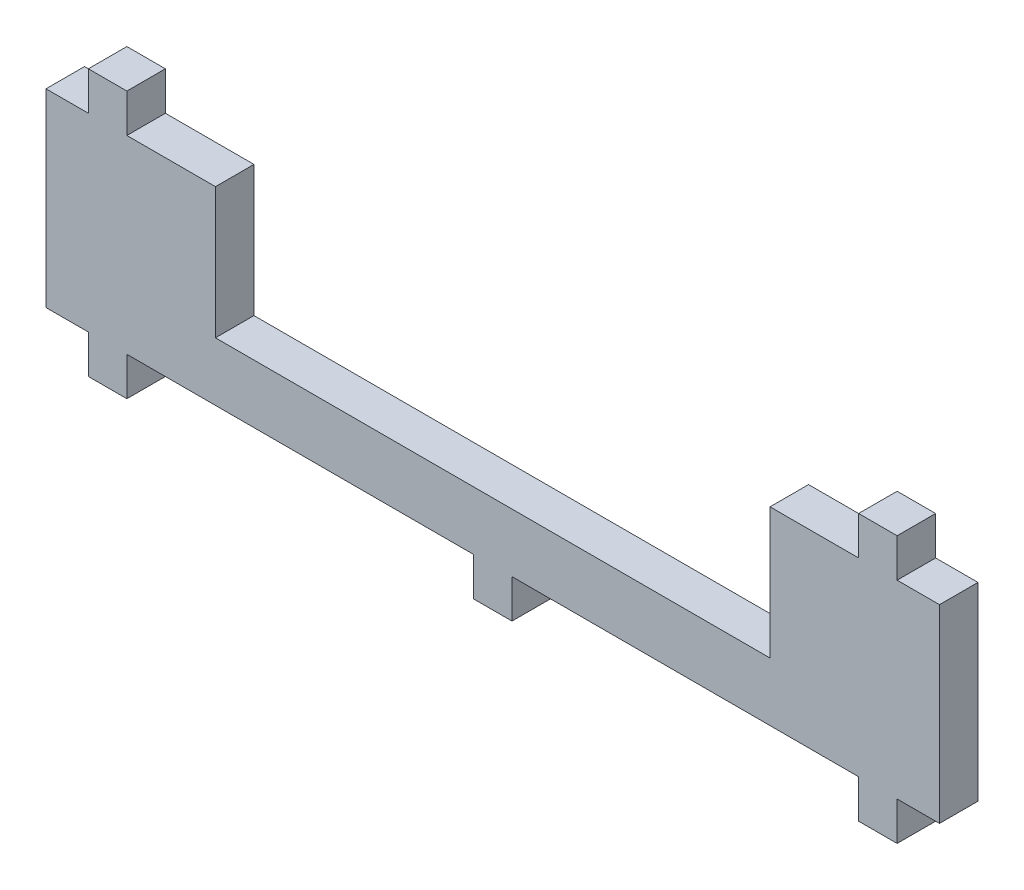
ISO-10303-21;
HEADER;
FILE_DESCRIPTION(('STEP AP214'),'2;1');
FILE_NAME('part.step','',(''),(''),'','','');
FILE_SCHEMA(('AUTOMOTIVE_DESIGN { 1 0 10303 214 1 1 1 1 }'));
ENDSEC;
DATA;
#1=APPLICATION_CONTEXT('core data for automotive mechanical design processes');
#2=APPLICATION_PROTOCOL_DEFINITION('international standard','automotive_design',2000,#1);
#3=PRODUCT_CONTEXT('',#1,'mechanical');
#4=PRODUCT('Part','Part','',(#3));
#5=PRODUCT_RELATED_PRODUCT_CATEGORY('part','',(#4));
#6=PRODUCT_DEFINITION_FORMATION('','',#4);
#7=PRODUCT_DEFINITION_CONTEXT('part definition',#1,'design');
#8=PRODUCT_DEFINITION('design','',#6,#7);
#9=PRODUCT_DEFINITION_SHAPE('','',#8);
#10=(LENGTH_UNIT() NAMED_UNIT(*) SI_UNIT(.MILLI.,.METRE.));
#11=(NAMED_UNIT(*) PLANE_ANGLE_UNIT() SI_UNIT($,.RADIAN.));
#12=(NAMED_UNIT(*) SI_UNIT($,.STERADIAN.) SOLID_ANGLE_UNIT());
#13=UNCERTAINTY_MEASURE_WITH_UNIT(LENGTH_MEASURE(1.E-05),#10,'distance_accuracy_value','');
#14=(GEOMETRIC_REPRESENTATION_CONTEXT(3) GLOBAL_UNCERTAINTY_ASSIGNED_CONTEXT((#13)) GLOBAL_UNIT_ASSIGNED_CONTEXT((#10,
#11,#12)) REPRESENTATION_CONTEXT('',''));
#15=CARTESIAN_POINT('',(0.,0.,0.));
#16=DIRECTION('',(0.,0.,1.));
#17=DIRECTION('',(1.,0.,0.));
#18=AXIS2_PLACEMENT_3D('',#15,#16,#17);
#19=CARTESIAN_POINT('',(-58.,-6.15,5.));
#20=DIRECTION('',(0.,1.,0.));
#21=DIRECTION('',(0.,0.,1.));
#22=AXIS2_PLACEMENT_3D('',#19,#20,#21);
#23=PLANE('',#22);
#24=DIRECTION('',(0.,0.,-1.));
#25=VECTOR('',#24,1.);
#26=CARTESIAN_POINT('',(-2.5,-6.15,5.));
#27=LINE('',#26,#25);
#28=CARTESIAN_POINT('',(-2.50000000000002,-6.15,5.));
#29=VERTEX_POINT('',#28);
#30=CARTESIAN_POINT('',(-2.50000000000002,-6.15,0.));
#31=VERTEX_POINT('',#30);
#32=EDGE_CURVE('E58',#29,#31,#27,.T.);
#33=ORIENTED_EDGE('',*,*,#32,.F.);
#34=DIRECTION('',(1.,0.,0.));
#35=VECTOR('',#34,1.);
#36=CARTESIAN_POINT('',(-58.,-6.15,5.));
#37=LINE('',#36,#35);
#38=CARTESIAN_POINT('',(-47.5,-6.15,5.));
#39=VERTEX_POINT('',#38);
#40=EDGE_CURVE('E447',#39,#29,#37,.T.);
#41=ORIENTED_EDGE('',*,*,#40,.F.);
#42=DIRECTION('',(0.,0.,1.));
#43=VECTOR('',#42,1.);
#44=CARTESIAN_POINT('',(-47.5,-6.15,5.));
#45=LINE('',#44,#43);
#46=CARTESIAN_POINT('',(-47.5,-6.15,0.));
#47=VERTEX_POINT('',#46);
#48=EDGE_CURVE('E435',#47,#39,#45,.T.);
#49=ORIENTED_EDGE('',*,*,#48,.F.);
#50=DIRECTION('',(1.,0.,0.));
#51=VECTOR('',#50,1.);
#52=CARTESIAN_POINT('',(-58.,-6.15,0.));
#53=LINE('',#52,#51);
#54=EDGE_CURVE('E477',#47,#31,#53,.T.);
#55=ORIENTED_EDGE('',*,*,#54,.T.);
#56=EDGE_LOOP('',(#33,#41,#49,#55));
#57=FACE_BOUND('',#56,.T.);
#58=ADVANCED_FACE('F33',(#57),#23,.F.);
#59=DIRECTION('',(0.,0.,1.));
#60=VECTOR('',#59,1.);
#61=CARTESIAN_POINT('',(2.5,-6.15,5.));
#62=LINE('',#61,#60);
#63=CARTESIAN_POINT('',(2.5,-6.15,0.));
#64=VERTEX_POINT('',#63);
#65=CARTESIAN_POINT('',(2.49999999999998,-6.15,5.));
#66=VERTEX_POINT('',#65);
#67=EDGE_CURVE('E242',#64,#66,#62,.T.);
#68=ORIENTED_EDGE('',*,*,#67,.F.);
#69=CARTESIAN_POINT('',(47.5,-6.15,0.));
#70=VERTEX_POINT('',#69);
#71=EDGE_CURVE('E468',#64,#70,#53,.T.);
#72=ORIENTED_EDGE('',*,*,#71,.T.);
#73=DIRECTION('',(0.,0.,-1.));
#74=VECTOR('',#73,1.);
#75=CARTESIAN_POINT('',(47.5,-6.15,5.));
#76=LINE('',#75,#74);
#77=CARTESIAN_POINT('',(47.5,-6.15,5.));
#78=VERTEX_POINT('',#77);
#79=EDGE_CURVE('E354',#78,#70,#76,.T.);
#80=ORIENTED_EDGE('',*,*,#79,.F.);
#81=EDGE_CURVE('E37',#66,#78,#37,.T.);
#82=ORIENTED_EDGE('',*,*,#81,.F.);
#83=EDGE_LOOP('',(#68,#72,#80,#82));
#84=FACE_BOUND('',#83,.T.);
#85=ADVANCED_FACE('F406',(#84),#23,.F.);
#86=CARTESIAN_POINT('',(-58.,18.45,5.));
#87=DIRECTION('',(0.,-1.,0.));
#88=DIRECTION('',(0.,0.,1.));
#89=AXIS2_PLACEMENT_3D('',#86,#87,#88);
#90=PLANE('',#89);
#91=DIRECTION('',(1.,0.,0.));
#92=VECTOR('',#91,1.);
#93=CARTESIAN_POINT('',(-58.,18.45,5.));
#94=LINE('',#93,#92);
#95=CARTESIAN_POINT('',(-47.5,18.45,5.));
#96=VERTEX_POINT('',#95);
#97=CARTESIAN_POINT('',(-36.,18.45,5.));
#98=VERTEX_POINT('',#97);
#99=EDGE_CURVE('E368',#96,#98,#94,.T.);
#100=ORIENTED_EDGE('',*,*,#99,.T.);
#101=DIRECTION('',(0.,0.,1.));
#102=VECTOR('',#101,1.);
#103=CARTESIAN_POINT('',(-36.,18.45,0.));
#104=LINE('',#103,#102);
#105=CARTESIAN_POINT('',(-36.,18.45,0.));
#106=VERTEX_POINT('',#105);
#107=EDGE_CURVE('E245',#106,#98,#104,.T.);
#108=ORIENTED_EDGE('',*,*,#107,.F.);
#109=DIRECTION('',(1.,0.,0.));
#110=VECTOR('',#109,1.);
#111=CARTESIAN_POINT('',(-58.,18.45,0.));
#112=LINE('',#111,#110);
#113=CARTESIAN_POINT('',(-47.5,18.45,0.));
#114=VERTEX_POINT('',#113);
#115=EDGE_CURVE('E345',#114,#106,#112,.T.);
#116=ORIENTED_EDGE('',*,*,#115,.F.);
#117=DIRECTION('',(0.,0.,1.));
#118=VECTOR('',#117,1.);
#119=CARTESIAN_POINT('',(-47.5,18.45,5.));
#120=LINE('',#119,#118);
#121=EDGE_CURVE('E306',#114,#96,#120,.T.);
#122=ORIENTED_EDGE('',*,*,#121,.T.);
#123=EDGE_LOOP('',(#100,#108,#116,#122));
#124=FACE_BOUND('',#123,.T.);
#125=ADVANCED_FACE('F395',(#124),#90,.F.);
#126=DIRECTION('',(0.,0.,1.));
#127=VECTOR('',#126,1.);
#128=CARTESIAN_POINT('',(52.5,-6.15,5.));
#129=LINE('',#128,#127);
#130=CARTESIAN_POINT('',(52.5,-6.15,0.));
#131=VERTEX_POINT('',#130);
#132=CARTESIAN_POINT('',(52.5,-6.15,5.));
#133=VERTEX_POINT('',#132);
#134=EDGE_CURVE('E359',#131,#133,#129,.T.);
#135=ORIENTED_EDGE('',*,*,#134,.F.);
#136=CARTESIAN_POINT('',(58.,-6.15,0.));
#137=VERTEX_POINT('',#136);
#138=EDGE_CURVE('E465',#131,#137,#53,.T.);
#139=ORIENTED_EDGE('',*,*,#138,.T.);
#140=DIRECTION('',(0.,0.,-1.));
#141=VECTOR('',#140,1.);
#142=CARTESIAN_POINT('',(58.,-6.15,5.));
#143=LINE('',#142,#141);
#144=CARTESIAN_POINT('',(58.,-6.15,5.));
#145=VERTEX_POINT('',#144);
#146=EDGE_CURVE('E43',#145,#137,#143,.T.);
#147=ORIENTED_EDGE('',*,*,#146,.F.);
#148=EDGE_CURVE('E469',#133,#145,#37,.T.);
#149=ORIENTED_EDGE('',*,*,#148,.F.);
#150=EDGE_LOOP('',(#135,#139,#147,#149));
#151=FACE_BOUND('',#150,.T.);
#152=ADVANCED_FACE('F405',(#151),#23,.F.);
#153=DIRECTION('',(0.,0.,-1.));
#154=VECTOR('',#153,1.);
#155=CARTESIAN_POINT('',(-52.5,-6.15,5.));
#156=LINE('',#155,#154);
#157=CARTESIAN_POINT('',(-52.5,-6.15,5.));
#158=VERTEX_POINT('',#157);
#159=CARTESIAN_POINT('',(-52.5,-6.15,0.));
#160=VERTEX_POINT('',#159);
#161=EDGE_CURVE('E427',#158,#160,#156,.T.);
#162=ORIENTED_EDGE('',*,*,#161,.F.);
#163=CARTESIAN_POINT('',(-58.,-6.15,5.));
#164=VERTEX_POINT('',#163);
#165=EDGE_CURVE('E429',#164,#158,#37,.T.);
#166=ORIENTED_EDGE('',*,*,#165,.F.);
#167=DIRECTION('',(0.,0.,-1.));
#168=VECTOR('',#167,1.);
#169=CARTESIAN_POINT('',(-58.,-6.15,5.));
#170=LINE('',#169,#168);
#171=CARTESIAN_POINT('',(-58.,-6.15,0.));
#172=VERTEX_POINT('',#171);
#173=EDGE_CURVE('E11',#164,#172,#170,.T.);
#174=ORIENTED_EDGE('',*,*,#173,.T.);
#175=EDGE_CURVE('E430',#172,#160,#53,.T.);
#176=ORIENTED_EDGE('',*,*,#175,.T.);
#177=EDGE_LOOP('',(#162,#166,#174,#176));
#178=FACE_BOUND('',#177,.T.);
#179=ADVANCED_FACE('F410',(#178),#23,.F.);
#180=CARTESIAN_POINT('',(58.,-6.15,5.));
#181=DIRECTION('',(-1.,0.,0.));
#182=DIRECTION('',(0.,0.,1.));
#183=AXIS2_PLACEMENT_3D('',#180,#181,#182);
#184=PLANE('',#183);
#185=DIRECTION('',(0.,1.,0.));
#186=VECTOR('',#185,1.);
#187=CARTESIAN_POINT('',(58.,-6.15,0.));
#188=LINE('',#187,#186);
#189=CARTESIAN_POINT('',(58.,18.45,0.));
#190=VERTEX_POINT('',#189);
#191=EDGE_CURVE('E518',#137,#190,#188,.T.);
#192=ORIENTED_EDGE('',*,*,#191,.T.);
#193=DIRECTION('',(0.,0.,-1.));
#194=VECTOR('',#193,1.);
#195=CARTESIAN_POINT('',(58.,18.45,5.));
#196=LINE('',#195,#194);
#197=CARTESIAN_POINT('',(58.,18.45,5.));
#198=VERTEX_POINT('',#197);
#199=EDGE_CURVE('E340',#198,#190,#196,.T.);
#200=ORIENTED_EDGE('',*,*,#199,.F.);
#201=DIRECTION('',(0.,1.,0.));
#202=VECTOR('',#201,1.);
#203=CARTESIAN_POINT('',(58.,-6.15,5.));
#204=LINE('',#203,#202);
#205=EDGE_CURVE('E480',#145,#198,#204,.T.);
#206=ORIENTED_EDGE('',*,*,#205,.F.);
#207=ORIENTED_EDGE('',*,*,#146,.T.);
#208=EDGE_LOOP('',(#192,#200,#206,#207));
#209=FACE_BOUND('',#208,.T.);
#210=ADVANCED_FACE('F35',(#209),#184,.F.);
#211=CARTESIAN_POINT('',(-58.,-6.15,5.));
#212=DIRECTION('',(1.,0.,0.));
#213=DIRECTION('',(0.,0.,-1.));
#214=AXIS2_PLACEMENT_3D('',#211,#212,#213);
#215=PLANE('',#214);
#216=DIRECTION('',(0.,-1.,0.));
#217=VECTOR('',#216,1.);
#218=CARTESIAN_POINT('',(-58.,-6.15,0.));
#219=LINE('',#218,#217);
#220=CARTESIAN_POINT('',(-58.,18.45,0.));
#221=VERTEX_POINT('',#220);
#222=EDGE_CURVE('E390',#221,#172,#219,.T.);
#223=ORIENTED_EDGE('',*,*,#222,.T.);
#224=ORIENTED_EDGE('',*,*,#173,.F.);
#225=DIRECTION('',(0.,-1.,0.));
#226=VECTOR('',#225,1.);
#227=CARTESIAN_POINT('',(-58.,-6.15,5.));
#228=LINE('',#227,#226);
#229=CARTESIAN_POINT('',(-58.,18.45,5.));
#230=VERTEX_POINT('',#229);
#231=EDGE_CURVE('E445',#230,#164,#228,.T.);
#232=ORIENTED_EDGE('',*,*,#231,.F.);
#233=DIRECTION('',(0.,0.,-1.));
#234=VECTOR('',#233,1.);
#235=CARTESIAN_POINT('',(-58.,18.45,5.));
#236=LINE('',#235,#234);
#237=EDGE_CURVE('E352',#230,#221,#236,.T.);
#238=ORIENTED_EDGE('',*,*,#237,.T.);
#239=EDGE_LOOP('',(#223,#224,#232,#238));
#240=FACE_BOUND('',#239,.T.);
#241=ADVANCED_FACE('F422',(#240),#215,.F.);
#242=CARTESIAN_POINT('',(0.,0.,5.));
#243=DIRECTION('',(0.,0.,-1.));
#244=DIRECTION('',(-1.,0.,0.));
#245=AXIS2_PLACEMENT_3D('',#242,#243,#244);
#246=PLANE('',#245);
#247=DIRECTION('',(1.,0.,0.));
#248=VECTOR('',#247,1.);
#249=CARTESIAN_POINT('',(-36.,1.45,5.));
#250=LINE('',#249,#248);
#251=CARTESIAN_POINT('',(-36.,1.45,5.));
#252=VERTEX_POINT('',#251);
#253=CARTESIAN_POINT('',(36.,1.45,5.));
#254=VERTEX_POINT('',#253);
#255=EDGE_CURVE('E256',#252,#254,#250,.T.);
#256=ORIENTED_EDGE('',*,*,#255,.F.);
#257=DIRECTION('',(0.,1.,0.));
#258=VECTOR('',#257,1.);
#259=CARTESIAN_POINT('',(-36.,1.45,5.));
#260=LINE('',#259,#258);
#261=EDGE_CURVE('E264',#252,#98,#260,.T.);
#262=ORIENTED_EDGE('',*,*,#261,.T.);
#263=ORIENTED_EDGE('',*,*,#99,.F.);
#264=DIRECTION('',(0.,-1.,0.));
#265=VECTOR('',#264,1.);
#266=CARTESIAN_POINT('',(-47.5,23.45,5.));
#267=LINE('',#266,#265);
#268=CARTESIAN_POINT('',(-47.5,23.45,5.));
#269=VERTEX_POINT('',#268);
#270=EDGE_CURVE('E326',#269,#96,#267,.T.);
#271=ORIENTED_EDGE('',*,*,#270,.F.);
#272=DIRECTION('',(-1.,0.,0.));
#273=VECTOR('',#272,1.);
#274=CARTESIAN_POINT('',(-52.5,23.45,5.));
#275=LINE('',#274,#273);
#276=CARTESIAN_POINT('',(-52.5,23.45,5.));
#277=VERTEX_POINT('',#276);
#278=EDGE_CURVE('E311',#269,#277,#275,.T.);
#279=ORIENTED_EDGE('',*,*,#278,.T.);
#280=DIRECTION('',(0.,-1.,0.));
#281=VECTOR('',#280,1.);
#282=CARTESIAN_POINT('',(-52.5,23.45,5.));
#283=LINE('',#282,#281);
#284=CARTESIAN_POINT('',(-52.5,18.45,5.));
#285=VERTEX_POINT('',#284);
#286=EDGE_CURVE('E314',#277,#285,#283,.T.);
#287=ORIENTED_EDGE('',*,*,#286,.T.);
#288=EDGE_CURVE('E362',#230,#285,#94,.T.);
#289=ORIENTED_EDGE('',*,*,#288,.F.);
#290=ORIENTED_EDGE('',*,*,#231,.T.);
#291=ORIENTED_EDGE('',*,*,#165,.T.);
#292=DIRECTION('',(0.,1.,0.));
#293=VECTOR('',#292,1.);
#294=CARTESIAN_POINT('',(-52.5,-11.15,5.));
#295=LINE('',#294,#293);
#296=CARTESIAN_POINT('',(-52.5,-11.15,5.));
#297=VERTEX_POINT('',#296);
#298=EDGE_CURVE('E443',#297,#158,#295,.T.);
#299=ORIENTED_EDGE('',*,*,#298,.F.);
#300=DIRECTION('',(-1.,0.,0.));
#301=VECTOR('',#300,1.);
#302=CARTESIAN_POINT('',(-52.5,-11.15,5.));
#303=LINE('',#302,#301);
#304=CARTESIAN_POINT('',(-47.5,-11.15,5.));
#305=VERTEX_POINT('',#304);
#306=EDGE_CURVE('E453',#305,#297,#303,.T.);
#307=ORIENTED_EDGE('',*,*,#306,.F.);
#308=DIRECTION('',(0.,1.,0.));
#309=VECTOR('',#308,1.);
#310=CARTESIAN_POINT('',(-47.5,-11.15,5.));
#311=LINE('',#310,#309);
#312=EDGE_CURVE('E452',#305,#39,#311,.T.);
#313=ORIENTED_EDGE('',*,*,#312,.T.);
#314=ORIENTED_EDGE('',*,*,#40,.T.);
#315=DIRECTION('',(0.,1.,0.));
#316=VECTOR('',#315,1.);
#317=CARTESIAN_POINT('',(-2.5,-11.15,5.));
#318=LINE('',#317,#316);
#319=CARTESIAN_POINT('',(-2.5,-11.15,5.));
#320=VERTEX_POINT('',#319);
#321=EDGE_CURVE('E578',#320,#29,#318,.T.);
#322=ORIENTED_EDGE('',*,*,#321,.F.);
#323=DIRECTION('',(-1.,0.,0.));
#324=VECTOR('',#323,1.);
#325=CARTESIAN_POINT('',(-2.5,-11.15,5.));
#326=LINE('',#325,#324);
#327=CARTESIAN_POINT('',(2.5,-11.15,5.));
#328=VERTEX_POINT('',#327);
#329=EDGE_CURVE('E238',#328,#320,#326,.T.);
#330=ORIENTED_EDGE('',*,*,#329,.F.);
#331=DIRECTION('',(0.,1.,0.));
#332=VECTOR('',#331,1.);
#333=CARTESIAN_POINT('',(2.5,-11.15,5.));
#334=LINE('',#333,#332);
#335=EDGE_CURVE('E249',#328,#66,#334,.T.);
#336=ORIENTED_EDGE('',*,*,#335,.T.);
#337=ORIENTED_EDGE('',*,*,#81,.T.);
#338=DIRECTION('',(0.,1.,0.));
#339=VECTOR('',#338,1.);
#340=CARTESIAN_POINT('',(47.5,-11.15,5.));
#341=LINE('',#340,#339);
#342=CARTESIAN_POINT('',(47.5,-11.15,5.));
#343=VERTEX_POINT('',#342);
#344=EDGE_CURVE('E548',#343,#78,#341,.T.);
#345=ORIENTED_EDGE('',*,*,#344,.F.);
#346=DIRECTION('',(-1.,0.,0.));
#347=VECTOR('',#346,1.);
#348=CARTESIAN_POINT('',(47.5,-11.15,5.));
#349=LINE('',#348,#347);
#350=CARTESIAN_POINT('',(52.5,-11.15,5.));
#351=VERTEX_POINT('',#350);
#352=EDGE_CURVE('E551',#351,#343,#349,.T.);
#353=ORIENTED_EDGE('',*,*,#352,.F.);
#354=DIRECTION('',(0.,1.,0.));
#355=VECTOR('',#354,1.);
#356=CARTESIAN_POINT('',(52.5,-11.15,5.));
#357=LINE('',#356,#355);
#358=EDGE_CURVE('E545',#351,#133,#357,.T.);
#359=ORIENTED_EDGE('',*,*,#358,.T.);
#360=ORIENTED_EDGE('',*,*,#148,.T.);
#361=ORIENTED_EDGE('',*,*,#205,.T.);
#362=CARTESIAN_POINT('',(52.5,18.45,5.));
#363=VERTEX_POINT('',#362);
#364=EDGE_CURVE('E335',#363,#198,#94,.T.);
#365=ORIENTED_EDGE('',*,*,#364,.F.);
#366=DIRECTION('',(0.,-1.,0.));
#367=VECTOR('',#366,1.);
#368=CARTESIAN_POINT('',(52.5,23.45,5.));
#369=LINE('',#368,#367);
#370=CARTESIAN_POINT('',(52.5,23.45,5.));
#371=VERTEX_POINT('',#370);
#372=EDGE_CURVE('E295',#371,#363,#369,.T.);
#373=ORIENTED_EDGE('',*,*,#372,.F.);
#374=DIRECTION('',(-1.,0.,0.));
#375=VECTOR('',#374,1.);
#376=CARTESIAN_POINT('',(47.5,23.45,5.));
#377=LINE('',#376,#375);
#378=CARTESIAN_POINT('',(47.5,23.45,5.));
#379=VERTEX_POINT('',#378);
#380=EDGE_CURVE('E285',#371,#379,#377,.T.);
#381=ORIENTED_EDGE('',*,*,#380,.T.);
#382=DIRECTION('',(0.,-1.,0.));
#383=VECTOR('',#382,1.);
#384=CARTESIAN_POINT('',(47.5,23.45,5.));
#385=LINE('',#384,#383);
#386=CARTESIAN_POINT('',(47.5,18.45,5.));
#387=VERTEX_POINT('',#386);
#388=EDGE_CURVE('E288',#379,#387,#385,.T.);
#389=ORIENTED_EDGE('',*,*,#388,.T.);
#390=CARTESIAN_POINT('',(36.,18.45,5.));
#391=VERTEX_POINT('',#390);
#392=EDGE_CURVE('E373',#391,#387,#94,.T.);
#393=ORIENTED_EDGE('',*,*,#392,.F.);
#394=DIRECTION('',(0.,1.,0.));
#395=VECTOR('',#394,1.);
#396=CARTESIAN_POINT('',(36.,1.45,5.));
#397=LINE('',#396,#395);
#398=EDGE_CURVE('E273',#254,#391,#397,.T.);
#399=ORIENTED_EDGE('',*,*,#398,.F.);
#400=EDGE_LOOP('',(#256,#262,#263,#271,#279,#287,#289,#290,#291,#299,#307,#313,#314,#322,#330,
#336,#337,#345,#353,#359,#360,#361,#365,#373,#381,#389,#393,#399));
#401=FACE_BOUND('',#400,.T.);
#402=ADVANCED_FACE('F441',(#401),#246,.F.);
#403=CARTESIAN_POINT('',(0.,0.,0.));
#404=DIRECTION('',(0.,0.,-1.));
#405=DIRECTION('',(-1.,0.,0.));
#406=AXIS2_PLACEMENT_3D('',#403,#404,#405);
#407=PLANE('',#406);
#408=DIRECTION('',(0.,1.,0.));
#409=VECTOR('',#408,1.);
#410=CARTESIAN_POINT('',(-36.,1.45,0.));
#411=LINE('',#410,#409);
#412=CARTESIAN_POINT('',(-36.,1.45,0.));
#413=VERTEX_POINT('',#412);
#414=EDGE_CURVE('E267',#413,#106,#411,.T.);
#415=ORIENTED_EDGE('',*,*,#414,.F.);
#416=DIRECTION('',(-1.,0.,0.));
#417=VECTOR('',#416,1.);
#418=CARTESIAN_POINT('',(-36.,1.45,0.));
#419=LINE('',#418,#417);
#420=CARTESIAN_POINT('',(36.,1.45,0.));
#421=VERTEX_POINT('',#420);
#422=EDGE_CURVE('E262',#421,#413,#419,.T.);
#423=ORIENTED_EDGE('',*,*,#422,.F.);
#424=DIRECTION('',(0.,1.,0.));
#425=VECTOR('',#424,1.);
#426=CARTESIAN_POINT('',(36.,1.45,0.));
#427=LINE('',#426,#425);
#428=CARTESIAN_POINT('',(36.,18.45,0.));
#429=VERTEX_POINT('',#428);
#430=EDGE_CURVE('E270',#421,#429,#427,.T.);
#431=ORIENTED_EDGE('',*,*,#430,.T.);
#432=CARTESIAN_POINT('',(47.5,18.45,0.));
#433=VERTEX_POINT('',#432);
#434=EDGE_CURVE('E333',#429,#433,#112,.T.);
#435=ORIENTED_EDGE('',*,*,#434,.T.);
#436=DIRECTION('',(0.,-1.,0.));
#437=VECTOR('',#436,1.);
#438=CARTESIAN_POINT('',(47.5,23.45,0.));
#439=LINE('',#438,#437);
#440=CARTESIAN_POINT('',(47.5,23.45,0.));
#441=VERTEX_POINT('',#440);
#442=EDGE_CURVE('E299',#441,#433,#439,.T.);
#443=ORIENTED_EDGE('',*,*,#442,.F.);
#444=DIRECTION('',(1.,0.,0.));
#445=VECTOR('',#444,1.);
#446=CARTESIAN_POINT('',(47.5,23.45,0.));
#447=LINE('',#446,#445);
#448=CARTESIAN_POINT('',(52.5,23.45,0.));
#449=VERTEX_POINT('',#448);
#450=EDGE_CURVE('E279',#441,#449,#447,.T.);
#451=ORIENTED_EDGE('',*,*,#450,.T.);
#452=DIRECTION('',(0.,-1.,0.));
#453=VECTOR('',#452,1.);
#454=CARTESIAN_POINT('',(52.5,23.45,0.));
#455=LINE('',#454,#453);
#456=CARTESIAN_POINT('',(52.5,18.45,0.));
#457=VERTEX_POINT('',#456);
#458=EDGE_CURVE('E297',#449,#457,#455,.T.);
#459=ORIENTED_EDGE('',*,*,#458,.T.);
#460=EDGE_CURVE('E329',#457,#190,#112,.T.);
#461=ORIENTED_EDGE('',*,*,#460,.T.);
#462=ORIENTED_EDGE('',*,*,#191,.F.);
#463=ORIENTED_EDGE('',*,*,#138,.F.);
#464=DIRECTION('',(0.,1.,0.));
#465=VECTOR('',#464,1.);
#466=CARTESIAN_POINT('',(52.5,-11.15,0.));
#467=LINE('',#466,#465);
#468=CARTESIAN_POINT('',(52.5,-11.15,0.));
#469=VERTEX_POINT('',#468);
#470=EDGE_CURVE('E542',#469,#131,#467,.T.);
#471=ORIENTED_EDGE('',*,*,#470,.F.);
#472=DIRECTION('',(1.,0.,0.));
#473=VECTOR('',#472,1.);
#474=CARTESIAN_POINT('',(47.5,-11.15,0.));
#475=LINE('',#474,#473);
#476=CARTESIAN_POINT('',(47.5,-11.15,0.));
#477=VERTEX_POINT('',#476);
#478=EDGE_CURVE('E558',#477,#469,#475,.T.);
#479=ORIENTED_EDGE('',*,*,#478,.F.);
#480=DIRECTION('',(0.,1.,0.));
#481=VECTOR('',#480,1.);
#482=CARTESIAN_POINT('',(47.5,-11.15,0.));
#483=LINE('',#482,#481);
#484=EDGE_CURVE('E436',#477,#70,#483,.T.);
#485=ORIENTED_EDGE('',*,*,#484,.T.);
#486=ORIENTED_EDGE('',*,*,#71,.F.);
#487=DIRECTION('',(0.,1.,0.));
#488=VECTOR('',#487,1.);
#489=CARTESIAN_POINT('',(2.5,-11.15,0.));
#490=LINE('',#489,#488);
#491=CARTESIAN_POINT('',(2.5,-11.15,0.));
#492=VERTEX_POINT('',#491);
#493=EDGE_CURVE('E229',#492,#64,#490,.T.);
#494=ORIENTED_EDGE('',*,*,#493,.F.);
#495=DIRECTION('',(1.,0.,0.));
#496=VECTOR('',#495,1.);
#497=CARTESIAN_POINT('',(-2.5,-11.15,0.));
#498=LINE('',#497,#496);
#499=CARTESIAN_POINT('',(-2.5,-11.15,0.));
#500=VERTEX_POINT('',#499);
#501=EDGE_CURVE('E221',#500,#492,#498,.T.);
#502=ORIENTED_EDGE('',*,*,#501,.F.);
#503=DIRECTION('',(0.,1.,0.));
#504=VECTOR('',#503,1.);
#505=CARTESIAN_POINT('',(-2.5,-11.15,0.));
#506=LINE('',#505,#504);
#507=EDGE_CURVE('E227',#500,#31,#506,.T.);
#508=ORIENTED_EDGE('',*,*,#507,.T.);
#509=ORIENTED_EDGE('',*,*,#54,.F.);
#510=DIRECTION('',(0.,1.,0.));
#511=VECTOR('',#510,1.);
#512=CARTESIAN_POINT('',(-47.5,-11.15,0.));
#513=LINE('',#512,#511);
#514=CARTESIAN_POINT('',(-47.5,-11.15,0.));
#515=VERTEX_POINT('',#514);
#516=EDGE_CURVE('E456',#515,#47,#513,.T.);
#517=ORIENTED_EDGE('',*,*,#516,.F.);
#518=DIRECTION('',(1.,0.,0.));
#519=VECTOR('',#518,1.);
#520=CARTESIAN_POINT('',(-52.5,-11.15,0.));
#521=LINE('',#520,#519);
#522=CARTESIAN_POINT('',(-52.5,-11.15,0.));
#523=VERTEX_POINT('',#522);
#524=EDGE_CURVE('E538',#523,#515,#521,.T.);
#525=ORIENTED_EDGE('',*,*,#524,.F.);
#526=DIRECTION('',(0.,1.,0.));
#527=VECTOR('',#526,1.);
#528=CARTESIAN_POINT('',(-52.5,-11.15,0.));
#529=LINE('',#528,#527);
#530=EDGE_CURVE('E522',#523,#160,#529,.T.);
#531=ORIENTED_EDGE('',*,*,#530,.T.);
#532=ORIENTED_EDGE('',*,*,#175,.F.);
#533=ORIENTED_EDGE('',*,*,#222,.F.);
#534=CARTESIAN_POINT('',(-52.5,18.45,0.));
#535=VERTEX_POINT('',#534);
#536=EDGE_CURVE('E350',#221,#535,#112,.T.);
#537=ORIENTED_EDGE('',*,*,#536,.T.);
#538=DIRECTION('',(0.,-1.,0.));
#539=VECTOR('',#538,1.);
#540=CARTESIAN_POINT('',(-52.5,23.45,0.));
#541=LINE('',#540,#539);
#542=CARTESIAN_POINT('',(-52.5,23.45,0.));
#543=VERTEX_POINT('',#542);
#544=EDGE_CURVE('E334',#543,#535,#541,.T.);
#545=ORIENTED_EDGE('',*,*,#544,.F.);
#546=DIRECTION('',(1.,0.,0.));
#547=VECTOR('',#546,1.);
#548=CARTESIAN_POINT('',(-52.5,23.45,0.));
#549=LINE('',#548,#547);
#550=CARTESIAN_POINT('',(-47.5,23.45,0.));
#551=VERTEX_POINT('',#550);
#552=EDGE_CURVE('E305',#543,#551,#549,.T.);
#553=ORIENTED_EDGE('',*,*,#552,.T.);
#554=DIRECTION('',(0.,-1.,0.));
#555=VECTOR('',#554,1.);
#556=CARTESIAN_POINT('',(-47.5,23.45,0.));
#557=LINE('',#556,#555);
#558=EDGE_CURVE('E379',#551,#114,#557,.T.);
#559=ORIENTED_EDGE('',*,*,#558,.T.);
#560=ORIENTED_EDGE('',*,*,#115,.T.);
#561=EDGE_LOOP('',(#415,#423,#431,#435,#443,#451,#459,#461,#462,#463,#471,#479,#485,#486,#494,
#502,#508,#509,#517,#525,#531,#532,#533,#537,#545,#553,#559,#560));
#562=FACE_BOUND('',#561,.T.);
#563=ADVANCED_FACE('F224',(#562),#407,.T.);
#564=CARTESIAN_POINT('',(-52.5,-11.15,5.));
#565=DIRECTION('',(1.,0.,0.));
#566=DIRECTION('',(0.,0.,-1.));
#567=AXIS2_PLACEMENT_3D('',#564,#565,#566);
#568=PLANE('',#567);
#569=ORIENTED_EDGE('',*,*,#161,.T.);
#570=ORIENTED_EDGE('',*,*,#530,.F.);
#571=DIRECTION('',(0.,0.,-1.));
#572=VECTOR('',#571,1.);
#573=CARTESIAN_POINT('',(-52.5,-11.15,5.));
#574=LINE('',#573,#572);
#575=EDGE_CURVE('E451',#297,#523,#574,.T.);
#576=ORIENTED_EDGE('',*,*,#575,.F.);
#577=ORIENTED_EDGE('',*,*,#298,.T.);
#578=EDGE_LOOP('',(#569,#570,#576,#577));
#579=FACE_BOUND('',#578,.T.);
#580=ADVANCED_FACE('F449',(#579),#568,.F.);
#581=CARTESIAN_POINT('',(-47.5,-11.15,5.));
#582=DIRECTION('',(-1.,0.,0.));
#583=DIRECTION('',(0.,0.,1.));
#584=AXIS2_PLACEMENT_3D('',#581,#582,#583);
#585=PLANE('',#584);
#586=ORIENTED_EDGE('',*,*,#48,.T.);
#587=ORIENTED_EDGE('',*,*,#312,.F.);
#588=DIRECTION('',(0.,0.,1.));
#589=VECTOR('',#588,1.);
#590=CARTESIAN_POINT('',(-47.5,-11.15,5.));
#591=LINE('',#590,#589);
#592=EDGE_CURVE('E458',#515,#305,#591,.T.);
#593=ORIENTED_EDGE('',*,*,#592,.F.);
#594=ORIENTED_EDGE('',*,*,#516,.T.);
#595=EDGE_LOOP('',(#586,#587,#593,#594));
#596=FACE_BOUND('',#595,.T.);
#597=ADVANCED_FACE('F585',(#596),#585,.F.);
#598=CARTESIAN_POINT('',(0.,-11.15,0.));
#599=DIRECTION('',(0.,-1.,0.));
#600=DIRECTION('',(0.,0.,-1.));
#601=AXIS2_PLACEMENT_3D('',#598,#599,#600);
#602=PLANE('',#601);
#603=ORIENTED_EDGE('',*,*,#575,.T.);
#604=ORIENTED_EDGE('',*,*,#524,.T.);
#605=ORIENTED_EDGE('',*,*,#592,.T.);
#606=ORIENTED_EDGE('',*,*,#306,.T.);
#607=EDGE_LOOP('',(#603,#604,#605,#606));
#608=FACE_BOUND('',#607,.T.);
#609=ADVANCED_FACE('F594',(#608),#602,.T.);
#610=CARTESIAN_POINT('',(47.5,-11.15,5.));
#611=DIRECTION('',(1.,0.,0.));
#612=DIRECTION('',(0.,0.,-1.));
#613=AXIS2_PLACEMENT_3D('',#610,#611,#612);
#614=PLANE('',#613);
#615=ORIENTED_EDGE('',*,*,#79,.T.);
#616=ORIENTED_EDGE('',*,*,#484,.F.);
#617=DIRECTION('',(0.,0.,-1.));
#618=VECTOR('',#617,1.);
#619=CARTESIAN_POINT('',(47.5,-11.15,5.));
#620=LINE('',#619,#618);
#621=EDGE_CURVE('E553',#343,#477,#620,.T.);
#622=ORIENTED_EDGE('',*,*,#621,.F.);
#623=ORIENTED_EDGE('',*,*,#344,.T.);
#624=EDGE_LOOP('',(#615,#616,#622,#623));
#625=FACE_BOUND('',#624,.T.);
#626=ADVANCED_FACE('F567',(#625),#614,.F.);
#627=CARTESIAN_POINT('',(52.5,-11.15,5.));
#628=DIRECTION('',(-1.,0.,0.));
#629=DIRECTION('',(0.,0.,1.));
#630=AXIS2_PLACEMENT_3D('',#627,#628,#629);
#631=PLANE('',#630);
#632=ORIENTED_EDGE('',*,*,#134,.T.);
#633=ORIENTED_EDGE('',*,*,#358,.F.);
#634=DIRECTION('',(0.,0.,1.));
#635=VECTOR('',#634,1.);
#636=CARTESIAN_POINT('',(52.5,-11.15,5.));
#637=LINE('',#636,#635);
#638=EDGE_CURVE('E556',#469,#351,#637,.T.);
#639=ORIENTED_EDGE('',*,*,#638,.F.);
#640=ORIENTED_EDGE('',*,*,#470,.T.);
#641=EDGE_LOOP('',(#632,#633,#639,#640));
#642=FACE_BOUND('',#641,.T.);
#643=ADVANCED_FACE('F571',(#642),#631,.F.);
#644=CARTESIAN_POINT('',(0.,-11.15,0.));
#645=DIRECTION('',(0.,-1.,0.));
#646=DIRECTION('',(0.,0.,-1.));
#647=AXIS2_PLACEMENT_3D('',#644,#645,#646);
#648=PLANE('',#647);
#649=ORIENTED_EDGE('',*,*,#621,.T.);
#650=ORIENTED_EDGE('',*,*,#478,.T.);
#651=ORIENTED_EDGE('',*,*,#638,.T.);
#652=ORIENTED_EDGE('',*,*,#352,.T.);
#653=EDGE_LOOP('',(#649,#650,#651,#652));
#654=FACE_BOUND('',#653,.T.);
#655=ADVANCED_FACE('F563',(#654),#648,.T.);
#656=ORIENTED_EDGE('',*,*,#434,.F.);
#657=DIRECTION('',(0.,0.,-1.));
#658=VECTOR('',#657,1.);
#659=CARTESIAN_POINT('',(36.,18.45,0.));
#660=LINE('',#659,#658);
#661=EDGE_CURVE('E247',#391,#429,#660,.T.);
#662=ORIENTED_EDGE('',*,*,#661,.F.);
#663=ORIENTED_EDGE('',*,*,#392,.T.);
#664=DIRECTION('',(0.,0.,-1.));
#665=VECTOR('',#664,1.);
#666=CARTESIAN_POINT('',(47.5,18.45,5.));
#667=LINE('',#666,#665);
#668=EDGE_CURVE('E269',#387,#433,#667,.T.);
#669=ORIENTED_EDGE('',*,*,#668,.T.);
#670=EDGE_LOOP('',(#656,#662,#663,#669));
#671=FACE_BOUND('',#670,.T.);
#672=ADVANCED_FACE('F402',(#671),#90,.F.);
#673=DIRECTION('',(0.,0.,1.));
#674=VECTOR('',#673,1.);
#675=CARTESIAN_POINT('',(52.5,18.45,5.));
#676=LINE('',#675,#674);
#677=EDGE_CURVE('E280',#457,#363,#676,.T.);
#678=ORIENTED_EDGE('',*,*,#677,.T.);
#679=ORIENTED_EDGE('',*,*,#364,.T.);
#680=ORIENTED_EDGE('',*,*,#199,.T.);
#681=ORIENTED_EDGE('',*,*,#460,.F.);
#682=EDGE_LOOP('',(#678,#679,#680,#681));
#683=FACE_BOUND('',#682,.T.);
#684=ADVANCED_FACE('F393',(#683),#90,.F.);
#685=DIRECTION('',(0.,0.,-1.));
#686=VECTOR('',#685,1.);
#687=CARTESIAN_POINT('',(-52.5,18.45,5.));
#688=LINE('',#687,#686);
#689=EDGE_CURVE('E302',#285,#535,#688,.T.);
#690=ORIENTED_EDGE('',*,*,#689,.T.);
#691=ORIENTED_EDGE('',*,*,#536,.F.);
#692=ORIENTED_EDGE('',*,*,#237,.F.);
#693=ORIENTED_EDGE('',*,*,#288,.T.);
#694=EDGE_LOOP('',(#690,#691,#692,#693));
#695=FACE_BOUND('',#694,.T.);
#696=ADVANCED_FACE('F391',(#695),#90,.F.);
#697=CARTESIAN_POINT('',(-52.5,23.45,5.));
#698=DIRECTION('',(1.,0.,0.));
#699=DIRECTION('',(0.,0.,-1.));
#700=AXIS2_PLACEMENT_3D('',#697,#698,#699);
#701=PLANE('',#700);
#702=ORIENTED_EDGE('',*,*,#689,.F.);
#703=ORIENTED_EDGE('',*,*,#286,.F.);
#704=DIRECTION('',(0.,0.,-1.));
#705=VECTOR('',#704,1.);
#706=CARTESIAN_POINT('',(-52.5,23.45,5.));
#707=LINE('',#706,#705);
#708=EDGE_CURVE('E303',#277,#543,#707,.T.);
#709=ORIENTED_EDGE('',*,*,#708,.T.);
#710=ORIENTED_EDGE('',*,*,#544,.T.);
#711=EDGE_LOOP('',(#702,#703,#709,#710));
#712=FACE_BOUND('',#711,.T.);
#713=ADVANCED_FACE('F386',(#712),#701,.F.);
#714=CARTESIAN_POINT('',(-47.5,23.45,5.));
#715=DIRECTION('',(-1.,0.,0.));
#716=DIRECTION('',(0.,0.,1.));
#717=AXIS2_PLACEMENT_3D('',#714,#715,#716);
#718=PLANE('',#717);
#719=ORIENTED_EDGE('',*,*,#121,.F.);
#720=ORIENTED_EDGE('',*,*,#558,.F.);
#721=DIRECTION('',(0.,0.,1.));
#722=VECTOR('',#721,1.);
#723=CARTESIAN_POINT('',(-47.5,23.45,5.));
#724=LINE('',#723,#722);
#725=EDGE_CURVE('E309',#551,#269,#724,.T.);
#726=ORIENTED_EDGE('',*,*,#725,.T.);
#727=ORIENTED_EDGE('',*,*,#270,.T.);
#728=EDGE_LOOP('',(#719,#720,#726,#727));
#729=FACE_BOUND('',#728,.T.);
#730=ADVANCED_FACE('F400',(#729),#718,.F.);
#731=CARTESIAN_POINT('',(0.,23.45,0.));
#732=DIRECTION('',(0.,1.,0.));
#733=DIRECTION('',(0.,0.,-1.));
#734=AXIS2_PLACEMENT_3D('',#731,#732,#733);
#735=PLANE('',#734);
#736=ORIENTED_EDGE('',*,*,#708,.F.);
#737=ORIENTED_EDGE('',*,*,#278,.F.);
#738=ORIENTED_EDGE('',*,*,#725,.F.);
#739=ORIENTED_EDGE('',*,*,#552,.F.);
#740=EDGE_LOOP('',(#736,#737,#738,#739));
#741=FACE_BOUND('',#740,.T.);
#742=ADVANCED_FACE('F713',(#741),#735,.T.);
#743=CARTESIAN_POINT('',(47.5,23.45,5.));
#744=DIRECTION('',(1.,0.,0.));
#745=DIRECTION('',(0.,0.,-1.));
#746=AXIS2_PLACEMENT_3D('',#743,#744,#745);
#747=PLANE('',#746);
#748=ORIENTED_EDGE('',*,*,#668,.F.);
#749=ORIENTED_EDGE('',*,*,#388,.F.);
#750=DIRECTION('',(0.,0.,-1.));
#751=VECTOR('',#750,1.);
#752=CARTESIAN_POINT('',(47.5,23.45,5.));
#753=LINE('',#752,#751);
#754=EDGE_CURVE('E277',#379,#441,#753,.T.);
#755=ORIENTED_EDGE('',*,*,#754,.T.);
#756=ORIENTED_EDGE('',*,*,#442,.T.);
#757=EDGE_LOOP('',(#748,#749,#755,#756));
#758=FACE_BOUND('',#757,.T.);
#759=ADVANCED_FACE('F506',(#758),#747,.F.);
#760=CARTESIAN_POINT('',(52.5,23.45,5.));
#761=DIRECTION('',(-1.,0.,0.));
#762=DIRECTION('',(0.,0.,1.));
#763=AXIS2_PLACEMENT_3D('',#760,#761,#762);
#764=PLANE('',#763);
#765=ORIENTED_EDGE('',*,*,#677,.F.);
#766=ORIENTED_EDGE('',*,*,#458,.F.);
#767=DIRECTION('',(0.,0.,1.));
#768=VECTOR('',#767,1.);
#769=CARTESIAN_POINT('',(52.5,23.45,5.));
#770=LINE('',#769,#768);
#771=EDGE_CURVE('E283',#449,#371,#770,.T.);
#772=ORIENTED_EDGE('',*,*,#771,.T.);
#773=ORIENTED_EDGE('',*,*,#372,.T.);
#774=EDGE_LOOP('',(#765,#766,#772,#773));
#775=FACE_BOUND('',#774,.T.);
#776=ADVANCED_FACE('F515',(#775),#764,.F.);
#777=CARTESIAN_POINT('',(0.,23.45,0.));
#778=DIRECTION('',(0.,1.,0.));
#779=DIRECTION('',(0.,0.,-1.));
#780=AXIS2_PLACEMENT_3D('',#777,#778,#779);
#781=PLANE('',#780);
#782=ORIENTED_EDGE('',*,*,#754,.F.);
#783=ORIENTED_EDGE('',*,*,#380,.F.);
#784=ORIENTED_EDGE('',*,*,#771,.F.);
#785=ORIENTED_EDGE('',*,*,#450,.F.);
#786=EDGE_LOOP('',(#782,#783,#784,#785));
#787=FACE_BOUND('',#786,.T.);
#788=ADVANCED_FACE('F510',(#787),#781,.T.);
#789=CARTESIAN_POINT('',(-36.,1.45,0.));
#790=DIRECTION('',(-1.,0.,0.));
#791=DIRECTION('',(0.,0.,1.));
#792=AXIS2_PLACEMENT_3D('',#789,#790,#791);
#793=PLANE('',#792);
#794=ORIENTED_EDGE('',*,*,#107,.T.);
#795=ORIENTED_EDGE('',*,*,#261,.F.);
#796=DIRECTION('',(0.,0.,1.));
#797=VECTOR('',#796,1.);
#798=CARTESIAN_POINT('',(-36.,1.45,0.));
#799=LINE('',#798,#797);
#800=EDGE_CURVE('E253',#413,#252,#799,.T.);
#801=ORIENTED_EDGE('',*,*,#800,.F.);
#802=ORIENTED_EDGE('',*,*,#414,.T.);
#803=EDGE_LOOP('',(#794,#795,#801,#802));
#804=FACE_BOUND('',#803,.T.);
#805=ADVANCED_FACE('F494',(#804),#793,.F.);
#806=CARTESIAN_POINT('',(36.,1.45,0.));
#807=DIRECTION('',(1.,0.,0.));
#808=DIRECTION('',(0.,0.,-1.));
#809=AXIS2_PLACEMENT_3D('',#806,#807,#808);
#810=PLANE('',#809);
#811=ORIENTED_EDGE('',*,*,#661,.T.);
#812=ORIENTED_EDGE('',*,*,#430,.F.);
#813=DIRECTION('',(0.,0.,-1.));
#814=VECTOR('',#813,1.);
#815=CARTESIAN_POINT('',(36.,1.45,0.));
#816=LINE('',#815,#814);
#817=EDGE_CURVE('E259',#254,#421,#816,.T.);
#818=ORIENTED_EDGE('',*,*,#817,.F.);
#819=ORIENTED_EDGE('',*,*,#398,.T.);
#820=EDGE_LOOP('',(#811,#812,#818,#819));
#821=FACE_BOUND('',#820,.T.);
#822=ADVANCED_FACE('F670',(#821),#810,.F.);
#823=CARTESIAN_POINT('',(0.,1.45,0.));
#824=DIRECTION('',(0.,1.,0.));
#825=DIRECTION('',(0.,0.,1.));
#826=AXIS2_PLACEMENT_3D('',#823,#824,#825);
#827=PLANE('',#826);
#828=ORIENTED_EDGE('',*,*,#800,.T.);
#829=ORIENTED_EDGE('',*,*,#255,.T.);
#830=ORIENTED_EDGE('',*,*,#817,.T.);
#831=ORIENTED_EDGE('',*,*,#422,.T.);
#832=EDGE_LOOP('',(#828,#829,#830,#831));
#833=FACE_BOUND('',#832,.T.);
#834=ADVANCED_FACE('F499',(#833),#827,.T.);
#835=CARTESIAN_POINT('',(-2.5,-11.15,5.));
#836=DIRECTION('',(1.,0.,0.));
#837=DIRECTION('',(0.,0.,-1.));
#838=AXIS2_PLACEMENT_3D('',#835,#836,#837);
#839=PLANE('',#838);
#840=ORIENTED_EDGE('',*,*,#32,.T.);
#841=ORIENTED_EDGE('',*,*,#507,.F.);
#842=DIRECTION('',(0.,0.,-1.));
#843=VECTOR('',#842,1.);
#844=CARTESIAN_POINT('',(-2.5,-11.15,5.));
#845=LINE('',#844,#843);
#846=EDGE_CURVE('E233',#320,#500,#845,.T.);
#847=ORIENTED_EDGE('',*,*,#846,.F.);
#848=ORIENTED_EDGE('',*,*,#321,.T.);
#849=EDGE_LOOP('',(#840,#841,#847,#848));
#850=FACE_BOUND('',#849,.T.);
#851=ADVANCED_FACE('F244',(#850),#839,.F.);
#852=CARTESIAN_POINT('',(2.5,-11.15,5.));
#853=DIRECTION('',(-1.,0.,0.));
#854=DIRECTION('',(0.,0.,1.));
#855=AXIS2_PLACEMENT_3D('',#852,#853,#854);
#856=PLANE('',#855);
#857=ORIENTED_EDGE('',*,*,#67,.T.);
#858=ORIENTED_EDGE('',*,*,#335,.F.);
#859=DIRECTION('',(0.,0.,1.));
#860=VECTOR('',#859,1.);
#861=CARTESIAN_POINT('',(2.5,-11.15,5.));
#862=LINE('',#861,#860);
#863=EDGE_CURVE('E232',#492,#328,#862,.T.);
#864=ORIENTED_EDGE('',*,*,#863,.F.);
#865=ORIENTED_EDGE('',*,*,#493,.T.);
#866=EDGE_LOOP('',(#857,#858,#864,#865));
#867=FACE_BOUND('',#866,.T.);
#868=ADVANCED_FACE('F576',(#867),#856,.F.);
#869=CARTESIAN_POINT('',(0.,-11.15,0.));
#870=DIRECTION('',(0.,-1.,0.));
#871=DIRECTION('',(0.,0.,-1.));
#872=AXIS2_PLACEMENT_3D('',#869,#870,#871);
#873=PLANE('',#872);
#874=ORIENTED_EDGE('',*,*,#846,.T.);
#875=ORIENTED_EDGE('',*,*,#501,.T.);
#876=ORIENTED_EDGE('',*,*,#863,.T.);
#877=ORIENTED_EDGE('',*,*,#329,.T.);
#878=EDGE_LOOP('',(#874,#875,#876,#877));
#879=FACE_BOUND('',#878,.T.);
#880=ADVANCED_FACE('F236',(#879),#873,.T.);
#881=CLOSED_SHELL('',(#58,#85,#125,#152,#179,#210,#241,#402,#563,#580,#597,#609,#626,#643,#655,
#672,#684,#696,#713,#730,#742,#759,#776,#788,#805,#822,#834,#851,#868,#880));
#882=MANIFOLD_SOLID_BREP('B2',#881);
#883=ADVANCED_BREP_SHAPE_REPRESENTATION('',(#18,#882),#14);
#884=SHAPE_DEFINITION_REPRESENTATION(#9,#883);
ENDSEC;
END-ISO-10303-21;
